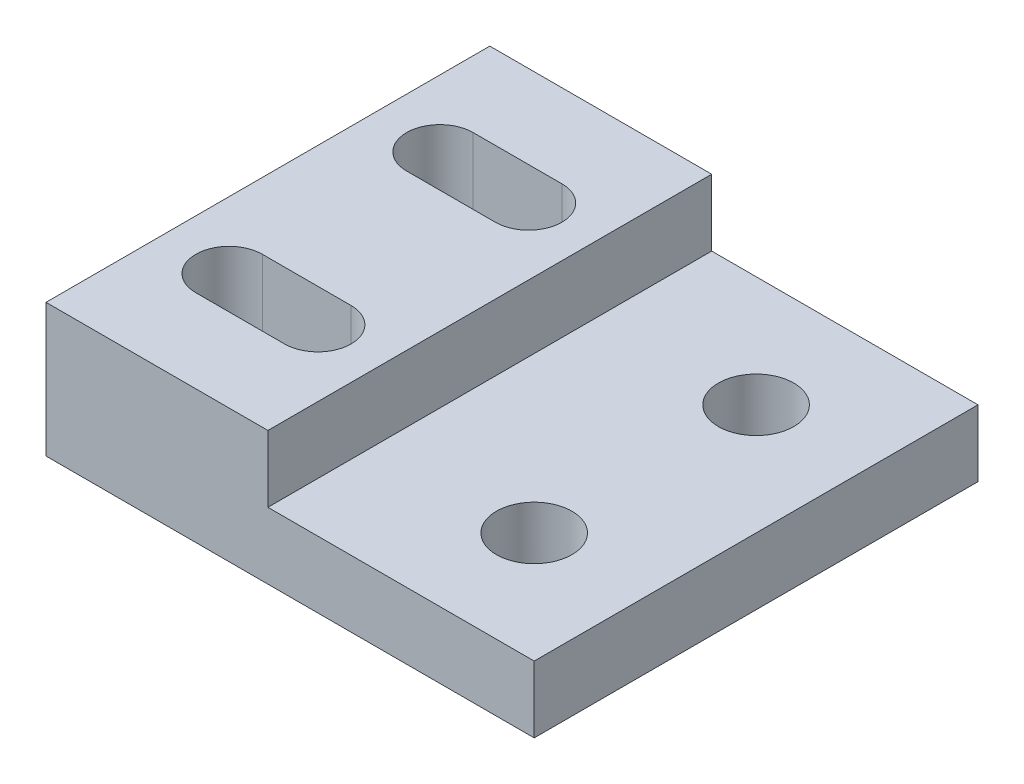
ISO-10303-21;
HEADER;
FILE_DESCRIPTION(('STEP AP214'),'2;1');
FILE_NAME('part.step','',(''),(''),'','','');
FILE_SCHEMA(('AUTOMOTIVE_DESIGN { 1 0 10303 214 1 1 1 1 }'));
ENDSEC;
DATA;
#1=APPLICATION_CONTEXT('core data for automotive mechanical design processes');
#2=APPLICATION_PROTOCOL_DEFINITION('international standard','automotive_design',2000,#1);
#3=PRODUCT_CONTEXT('',#1,'mechanical');
#4=PRODUCT('Part','Part','',(#3));
#5=PRODUCT_RELATED_PRODUCT_CATEGORY('part','',(#4));
#6=PRODUCT_DEFINITION_FORMATION('','',#4);
#7=PRODUCT_DEFINITION_CONTEXT('part definition',#1,'design');
#8=PRODUCT_DEFINITION('design','',#6,#7);
#9=PRODUCT_DEFINITION_SHAPE('','',#8);
#10=(LENGTH_UNIT() NAMED_UNIT(*) SI_UNIT(.MILLI.,.METRE.));
#11=(NAMED_UNIT(*) PLANE_ANGLE_UNIT() SI_UNIT($,.RADIAN.));
#12=(NAMED_UNIT(*) SI_UNIT($,.STERADIAN.) SOLID_ANGLE_UNIT());
#13=UNCERTAINTY_MEASURE_WITH_UNIT(LENGTH_MEASURE(1.E-05),#10,'distance_accuracy_value','');
#14=(GEOMETRIC_REPRESENTATION_CONTEXT(3) GLOBAL_UNCERTAINTY_ASSIGNED_CONTEXT((#13)) GLOBAL_UNIT_ASSIGNED_CONTEXT((#10,
#11,#12)) REPRESENTATION_CONTEXT('',''));
#15=CARTESIAN_POINT('',(0.,0.,0.));
#16=DIRECTION('',(0.,0.,1.));
#17=DIRECTION('',(1.,0.,0.));
#18=AXIS2_PLACEMENT_3D('',#15,#16,#17);
#19=CARTESIAN_POINT('',(11.,3.,10.));
#20=DIRECTION('',(-1.,0.,0.));
#21=DIRECTION('',(0.,0.,1.));
#22=AXIS2_PLACEMENT_3D('',#19,#20,#21);
#23=PLANE('',#22);
#24=DIRECTION('',(0.,0.,-1.));
#25=VECTOR('',#24,1.);
#26=CARTESIAN_POINT('',(11.,0.,10.));
#27=LINE('',#26,#25);
#28=CARTESIAN_POINT('',(11.,0.,10.));
#29=VERTEX_POINT('',#28);
#30=CARTESIAN_POINT('',(11.,0.,-10.));
#31=VERTEX_POINT('',#30);
#32=EDGE_CURVE('E285',#29,#31,#27,.T.);
#33=ORIENTED_EDGE('',*,*,#32,.T.);
#34=DIRECTION('',(0.,-1.,0.));
#35=VECTOR('',#34,1.);
#36=CARTESIAN_POINT('',(11.,3.,-10.));
#37=LINE('',#36,#35);
#38=CARTESIAN_POINT('',(11.,3.,-10.));
#39=VERTEX_POINT('',#38);
#40=EDGE_CURVE('E11',#39,#31,#37,.T.);
#41=ORIENTED_EDGE('',*,*,#40,.F.);
#42=DIRECTION('',(0.,0.,-1.));
#43=VECTOR('',#42,1.);
#44=CARTESIAN_POINT('',(11.,3.,10.));
#45=LINE('',#44,#43);
#46=CARTESIAN_POINT('',(11.,3.,10.));
#47=VERTEX_POINT('',#46);
#48=EDGE_CURVE('E273',#47,#39,#45,.T.);
#49=ORIENTED_EDGE('',*,*,#48,.F.);
#50=DIRECTION('',(0.,-1.,0.));
#51=VECTOR('',#50,1.);
#52=CARTESIAN_POINT('',(11.,3.,10.));
#53=LINE('',#52,#51);
#54=EDGE_CURVE('E284',#47,#29,#53,.T.);
#55=ORIENTED_EDGE('',*,*,#54,.T.);
#56=EDGE_LOOP('',(#33,#41,#49,#55));
#57=FACE_BOUND('',#56,.T.);
#58=ADVANCED_FACE('F41',(#57),#23,.F.);
#59=CARTESIAN_POINT('',(-11.,3.,-10.));
#60=DIRECTION('',(0.,0.,1.));
#61=DIRECTION('',(1.,0.,0.));
#62=AXIS2_PLACEMENT_3D('',#59,#60,#61);
#63=PLANE('',#62);
#64=DIRECTION('',(-1.,0.,0.));
#65=VECTOR('',#64,1.);
#66=CARTESIAN_POINT('',(-11.,0.,-10.));
#67=LINE('',#66,#65);
#68=CARTESIAN_POINT('',(-11.,0.,-10.));
#69=VERTEX_POINT('',#68);
#70=EDGE_CURVE('E289',#31,#69,#67,.T.);
#71=ORIENTED_EDGE('',*,*,#70,.T.);
#72=DIRECTION('',(0.,-1.,0.));
#73=VECTOR('',#72,1.);
#74=CARTESIAN_POINT('',(-11.,3.,-10.));
#75=LINE('',#74,#73);
#76=CARTESIAN_POINT('',(-11.,6.,-10.));
#77=VERTEX_POINT('',#76);
#78=EDGE_CURVE('E50',#77,#69,#75,.T.);
#79=ORIENTED_EDGE('',*,*,#78,.F.);
#80=DIRECTION('',(-1.,0.,0.));
#81=VECTOR('',#80,1.);
#82=CARTESIAN_POINT('',(0.,6.,-10.));
#83=LINE('',#82,#81);
#84=CARTESIAN_POINT('',(-0.999999999999996,6.,-10.));
#85=VERTEX_POINT('',#84);
#86=EDGE_CURVE('E155',#85,#77,#83,.T.);
#87=ORIENTED_EDGE('',*,*,#86,.F.);
#88=DIRECTION('',(0.,-1.,0.));
#89=VECTOR('',#88,1.);
#90=CARTESIAN_POINT('',(-0.999999999999996,6.,-10.));
#91=LINE('',#90,#89);
#92=CARTESIAN_POINT('',(-0.999999999999996,3.,-10.));
#93=VERTEX_POINT('',#92);
#94=EDGE_CURVE('E143',#85,#93,#91,.T.);
#95=ORIENTED_EDGE('',*,*,#94,.T.);
#96=DIRECTION('',(-1.,0.,0.));
#97=VECTOR('',#96,1.);
#98=CARTESIAN_POINT('',(-11.,3.,-10.));
#99=LINE('',#98,#97);
#100=EDGE_CURVE('E277',#39,#93,#99,.T.);
#101=ORIENTED_EDGE('',*,*,#100,.F.);
#102=ORIENTED_EDGE('',*,*,#40,.T.);
#103=EDGE_LOOP('',(#71,#79,#87,#95,#101,#102));
#104=FACE_BOUND('',#103,.T.);
#105=ADVANCED_FACE('F156',(#104),#63,.F.);
#106=CARTESIAN_POINT('',(-11.,3.,10.));
#107=DIRECTION('',(1.,0.,0.));
#108=DIRECTION('',(0.,0.,-1.));
#109=AXIS2_PLACEMENT_3D('',#106,#107,#108);
#110=PLANE('',#109);
#111=DIRECTION('',(0.,0.,1.));
#112=VECTOR('',#111,1.);
#113=CARTESIAN_POINT('',(-11.,0.,10.));
#114=LINE('',#113,#112);
#115=CARTESIAN_POINT('',(-11.,0.,10.));
#116=VERTEX_POINT('',#115);
#117=EDGE_CURVE('E292',#69,#116,#114,.T.);
#118=ORIENTED_EDGE('',*,*,#117,.T.);
#119=DIRECTION('',(0.,-1.,0.));
#120=VECTOR('',#119,1.);
#121=CARTESIAN_POINT('',(-11.,3.,10.));
#122=LINE('',#121,#120);
#123=CARTESIAN_POINT('',(-11.,6.,10.));
#124=VERTEX_POINT('',#123);
#125=EDGE_CURVE('E300',#124,#116,#122,.T.);
#126=ORIENTED_EDGE('',*,*,#125,.F.);
#127=DIRECTION('',(0.,0.,1.));
#128=VECTOR('',#127,1.);
#129=CARTESIAN_POINT('',(-11.,6.,0.));
#130=LINE('',#129,#128);
#131=EDGE_CURVE('E162',#77,#124,#130,.T.);
#132=ORIENTED_EDGE('',*,*,#131,.F.);
#133=ORIENTED_EDGE('',*,*,#78,.T.);
#134=EDGE_LOOP('',(#118,#126,#132,#133));
#135=FACE_BOUND('',#134,.T.);
#136=ADVANCED_FACE('F329',(#135),#110,.F.);
#137=CARTESIAN_POINT('',(-11.,3.,10.));
#138=DIRECTION('',(0.,0.,-1.));
#139=DIRECTION('',(-1.,0.,0.));
#140=AXIS2_PLACEMENT_3D('',#137,#138,#139);
#141=PLANE('',#140);
#142=DIRECTION('',(1.,0.,0.));
#143=VECTOR('',#142,1.);
#144=CARTESIAN_POINT('',(-11.,0.,10.));
#145=LINE('',#144,#143);
#146=EDGE_CURVE('E278',#116,#29,#145,.T.);
#147=ORIENTED_EDGE('',*,*,#146,.T.);
#148=ORIENTED_EDGE('',*,*,#54,.F.);
#149=DIRECTION('',(1.,0.,0.));
#150=VECTOR('',#149,1.);
#151=CARTESIAN_POINT('',(-11.,3.,10.));
#152=LINE('',#151,#150);
#153=CARTESIAN_POINT('',(-0.999999999999994,3.,10.));
#154=VERTEX_POINT('',#153);
#155=EDGE_CURVE('E281',#154,#47,#152,.T.);
#156=ORIENTED_EDGE('',*,*,#155,.F.);
#157=DIRECTION('',(0.,-1.,0.));
#158=VECTOR('',#157,1.);
#159=CARTESIAN_POINT('',(-0.999999999999994,6.,10.));
#160=LINE('',#159,#158);
#161=CARTESIAN_POINT('',(-0.999999999999994,6.,10.));
#162=VERTEX_POINT('',#161);
#163=EDGE_CURVE('E58',#162,#154,#160,.T.);
#164=ORIENTED_EDGE('',*,*,#163,.F.);
#165=DIRECTION('',(1.,0.,0.));
#166=VECTOR('',#165,1.);
#167=CARTESIAN_POINT('',(0.,6.,10.));
#168=LINE('',#167,#166);
#169=EDGE_CURVE('E167',#124,#162,#168,.T.);
#170=ORIENTED_EDGE('',*,*,#169,.F.);
#171=ORIENTED_EDGE('',*,*,#125,.T.);
#172=EDGE_LOOP('',(#147,#148,#156,#164,#170,#171));
#173=FACE_BOUND('',#172,.T.);
#174=ADVANCED_FACE('F327',(#173),#141,.F.);
#175=CARTESIAN_POINT('',(0.,3.,0.));
#176=DIRECTION('',(0.,-1.,0.));
#177=DIRECTION('',(0.,0.,-1.));
#178=AXIS2_PLACEMENT_3D('',#175,#176,#177);
#179=PLANE('',#178);
#180=CARTESIAN_POINT('',(6.,3.,-5.));
#181=DIRECTION('',(0.,1.,0.));
#182=DIRECTION('',(0.,0.,1.));
#183=AXIS2_PLACEMENT_3D('',#180,#181,#182);
#184=CIRCLE('',#183,1.7);
#185=CARTESIAN_POINT('',(6.,3.,-3.3));
#186=VERTEX_POINT('',#185);
#187=EDGE_CURVE('E230',#186,#186,#184,.T.);
#188=ORIENTED_EDGE('',*,*,#187,.F.);
#189=EDGE_LOOP('',(#188));
#190=FACE_BOUND('',#189,.T.);
#191=CARTESIAN_POINT('',(6.,3.,5.));
#192=DIRECTION('',(0.,1.,0.));
#193=DIRECTION('',(0.,0.,1.));
#194=AXIS2_PLACEMENT_3D('',#191,#192,#193);
#195=CIRCLE('',#194,1.7);
#196=CARTESIAN_POINT('',(6.,3.,6.7));
#197=VERTEX_POINT('',#196);
#198=EDGE_CURVE('E268',#197,#197,#195,.T.);
#199=ORIENTED_EDGE('',*,*,#198,.F.);
#200=EDGE_LOOP('',(#199));
#201=FACE_BOUND('',#200,.T.);
#202=ORIENTED_EDGE('',*,*,#100,.T.);
#203=DIRECTION('',(0.,0.,1.));
#204=VECTOR('',#203,1.);
#205=CARTESIAN_POINT('',(-0.999999999999995,3.,0.));
#206=LINE('',#205,#204);
#207=EDGE_CURVE('E148',#93,#154,#206,.T.);
#208=ORIENTED_EDGE('',*,*,#207,.T.);
#209=ORIENTED_EDGE('',*,*,#155,.T.);
#210=ORIENTED_EDGE('',*,*,#48,.T.);
#211=EDGE_LOOP('',(#202,#208,#209,#210));
#212=FACE_BOUND('',#211,.T.);
#213=ADVANCED_FACE('F315',(#190,#201,#212),#179,.F.);
#214=CARTESIAN_POINT('',(0.,0.,0.));
#215=DIRECTION('',(0.,-1.,0.));
#216=DIRECTION('',(0.,0.,-1.));
#217=AXIS2_PLACEMENT_3D('',#214,#215,#216);
#218=PLANE('',#217);
#219=CARTESIAN_POINT('',(-8.,0.,-4.75));
#220=DIRECTION('',(0.,1.,0.));
#221=DIRECTION('',(0.,0.,1.));
#222=AXIS2_PLACEMENT_3D('',#219,#220,#221);
#223=CIRCLE('',#222,1.5);
#224=CARTESIAN_POINT('',(-8.,0.,-6.25));
#225=VERTEX_POINT('',#224);
#226=CARTESIAN_POINT('',(-8.,0.,-3.25));
#227=VERTEX_POINT('',#226);
#228=EDGE_CURVE('E211',#225,#227,#223,.T.);
#229=ORIENTED_EDGE('',*,*,#228,.T.);
#230=DIRECTION('',(1.,0.,0.));
#231=VECTOR('',#230,1.);
#232=CARTESIAN_POINT('',(-8.,0.,-3.25));
#233=LINE('',#232,#231);
#234=CARTESIAN_POINT('',(-4.,0.,-3.25));
#235=VERTEX_POINT('',#234);
#236=EDGE_CURVE('E215',#227,#235,#233,.T.);
#237=ORIENTED_EDGE('',*,*,#236,.T.);
#238=CARTESIAN_POINT('',(-4.,0.,-4.75));
#239=DIRECTION('',(0.,1.,0.));
#240=DIRECTION('',(0.,0.,1.));
#241=AXIS2_PLACEMENT_3D('',#238,#239,#240);
#242=CIRCLE('',#241,1.5);
#243=CARTESIAN_POINT('',(-4.,0.,-6.25));
#244=VERTEX_POINT('',#243);
#245=EDGE_CURVE('E66',#235,#244,#242,.T.);
#246=ORIENTED_EDGE('',*,*,#245,.T.);
#247=DIRECTION('',(-1.,0.,0.));
#248=VECTOR('',#247,1.);
#249=CARTESIAN_POINT('',(-8.,0.,-6.25));
#250=LINE('',#249,#248);
#251=EDGE_CURVE('E222',#244,#225,#250,.T.);
#252=ORIENTED_EDGE('',*,*,#251,.T.);
#253=EDGE_LOOP('',(#229,#237,#246,#252));
#254=FACE_BOUND('',#253,.T.);
#255=CARTESIAN_POINT('',(-8.,0.,4.75));
#256=DIRECTION('',(0.,1.,0.));
#257=DIRECTION('',(0.,0.,1.));
#258=AXIS2_PLACEMENT_3D('',#255,#256,#257);
#259=CIRCLE('',#258,1.5);
#260=CARTESIAN_POINT('',(-8.,0.,3.25));
#261=VERTEX_POINT('',#260);
#262=CARTESIAN_POINT('',(-8.,0.,6.25));
#263=VERTEX_POINT('',#262);
#264=EDGE_CURVE('E152',#261,#263,#259,.T.);
#265=ORIENTED_EDGE('',*,*,#264,.T.);
#266=DIRECTION('',(1.,0.,0.));
#267=VECTOR('',#266,1.);
#268=CARTESIAN_POINT('',(-8.,0.,6.25));
#269=LINE('',#268,#267);
#270=CARTESIAN_POINT('',(-4.,0.,6.25));
#271=VERTEX_POINT('',#270);
#272=EDGE_CURVE('E242',#263,#271,#269,.T.);
#273=ORIENTED_EDGE('',*,*,#272,.T.);
#274=CARTESIAN_POINT('',(-4.,0.,4.75));
#275=DIRECTION('',(0.,1.,0.));
#276=DIRECTION('',(0.,0.,1.));
#277=AXIS2_PLACEMENT_3D('',#274,#275,#276);
#278=CIRCLE('',#277,1.5);
#279=CARTESIAN_POINT('',(-4.,0.,3.25));
#280=VERTEX_POINT('',#279);
#281=EDGE_CURVE('E246',#271,#280,#278,.T.);
#282=ORIENTED_EDGE('',*,*,#281,.T.);
#283=DIRECTION('',(-1.,0.,0.));
#284=VECTOR('',#283,1.);
#285=CARTESIAN_POINT('',(-8.,0.,3.25));
#286=LINE('',#285,#284);
#287=EDGE_CURVE('E250',#280,#261,#286,.T.);
#288=ORIENTED_EDGE('',*,*,#287,.T.);
#289=EDGE_LOOP('',(#265,#273,#282,#288));
#290=FACE_BOUND('',#289,.T.);
#291=CARTESIAN_POINT('',(6.,0.,-5.));
#292=DIRECTION('',(0.,-1.,0.));
#293=DIRECTION('',(0.,0.,-1.));
#294=AXIS2_PLACEMENT_3D('',#291,#292,#293);
#295=CIRCLE('',#294,1.7);
#296=CARTESIAN_POINT('',(6.,0.,-6.7));
#297=VERTEX_POINT('',#296);
#298=EDGE_CURVE('E44',#297,#297,#295,.T.);
#299=ORIENTED_EDGE('',*,*,#298,.F.);
#300=EDGE_LOOP('',(#299));
#301=FACE_BOUND('',#300,.T.);
#302=CARTESIAN_POINT('',(6.,0.,5.));
#303=DIRECTION('',(0.,-1.,0.));
#304=DIRECTION('',(0.,0.,-1.));
#305=AXIS2_PLACEMENT_3D('',#302,#303,#304);
#306=CIRCLE('',#305,1.7);
#307=CARTESIAN_POINT('',(6.,0.,3.3));
#308=VERTEX_POINT('',#307);
#309=EDGE_CURVE('E272',#308,#308,#306,.T.);
#310=ORIENTED_EDGE('',*,*,#309,.F.);
#311=EDGE_LOOP('',(#310));
#312=FACE_BOUND('',#311,.T.);
#313=ORIENTED_EDGE('',*,*,#32,.F.);
#314=ORIENTED_EDGE('',*,*,#146,.F.);
#315=ORIENTED_EDGE('',*,*,#117,.F.);
#316=ORIENTED_EDGE('',*,*,#70,.F.);
#317=EDGE_LOOP('',(#313,#314,#315,#316));
#318=FACE_BOUND('',#317,.T.);
#319=ADVANCED_FACE('F312',(#254,#290,#301,#312,#318),#218,.T.);
#320=CARTESIAN_POINT('',(6.,3.,5.));
#321=DIRECTION('',(0.,1.,0.));
#322=DIRECTION('',(0.,0.,1.));
#323=AXIS2_PLACEMENT_3D('',#320,#321,#322);
#324=CYLINDRICAL_SURFACE('',#323,1.7);
#325=ORIENTED_EDGE('',*,*,#309,.T.);
#326=EDGE_LOOP('',(#325));
#327=FACE_BOUND('',#326,.T.);
#328=ORIENTED_EDGE('',*,*,#198,.T.);
#329=EDGE_LOOP('',(#328));
#330=FACE_BOUND('',#329,.T.);
#331=ADVANCED_FACE('F309',(#327,#330),#324,.F.);
#332=CARTESIAN_POINT('',(6.,3.,-5.));
#333=DIRECTION('',(0.,1.,0.));
#334=DIRECTION('',(0.,0.,1.));
#335=AXIS2_PLACEMENT_3D('',#332,#333,#334);
#336=CYLINDRICAL_SURFACE('',#335,1.7);
#337=ORIENTED_EDGE('',*,*,#298,.T.);
#338=EDGE_LOOP('',(#337));
#339=FACE_BOUND('',#338,.T.);
#340=ORIENTED_EDGE('',*,*,#187,.T.);
#341=EDGE_LOOP('',(#340));
#342=FACE_BOUND('',#341,.T.);
#343=ADVANCED_FACE('F387',(#339,#342),#336,.F.);
#344=CARTESIAN_POINT('',(-8.,0.,4.75));
#345=DIRECTION('',(0.,1.,0.));
#346=DIRECTION('',(0.,0.,1.));
#347=AXIS2_PLACEMENT_3D('',#344,#345,#346);
#348=CYLINDRICAL_SURFACE('',#347,1.5);
#349=DIRECTION('',(0.,1.,0.));
#350=VECTOR('',#349,1.);
#351=CARTESIAN_POINT('',(-8.,0.,3.25));
#352=LINE('',#351,#350);
#353=CARTESIAN_POINT('',(-8.,6.,3.25));
#354=VERTEX_POINT('',#353);
#355=EDGE_CURVE('E216',#261,#354,#352,.T.);
#356=ORIENTED_EDGE('',*,*,#355,.T.);
#357=CARTESIAN_POINT('',(-8.,6.,4.75));
#358=DIRECTION('',(0.,1.,0.));
#359=DIRECTION('',(0.,0.,1.));
#360=AXIS2_PLACEMENT_3D('',#357,#358,#359);
#361=CIRCLE('',#360,1.5);
#362=CARTESIAN_POINT('',(-8.,6.,6.25));
#363=VERTEX_POINT('',#362);
#364=EDGE_CURVE('E185',#363,#354,#361,.F.);
#365=ORIENTED_EDGE('',*,*,#364,.F.);
#366=DIRECTION('',(0.,1.,0.));
#367=VECTOR('',#366,1.);
#368=CARTESIAN_POINT('',(-8.,0.,6.25));
#369=LINE('',#368,#367);
#370=EDGE_CURVE('E254',#263,#363,#369,.T.);
#371=ORIENTED_EDGE('',*,*,#370,.F.);
#372=ORIENTED_EDGE('',*,*,#264,.F.);
#373=EDGE_LOOP('',(#356,#365,#371,#372));
#374=FACE_BOUND('',#373,.T.);
#375=ADVANCED_FACE('F392',(#374),#348,.F.);
#376=CARTESIAN_POINT('',(-8.,0.,3.25));
#377=DIRECTION('',(0.,0.,-1.));
#378=DIRECTION('',(-1.,0.,0.));
#379=AXIS2_PLACEMENT_3D('',#376,#377,#378);
#380=PLANE('',#379);
#381=DIRECTION('',(0.,1.,0.));
#382=VECTOR('',#381,1.);
#383=CARTESIAN_POINT('',(-4.,0.,3.25));
#384=LINE('',#383,#382);
#385=CARTESIAN_POINT('',(-4.,6.,3.25));
#386=VERTEX_POINT('',#385);
#387=EDGE_CURVE('E257',#280,#386,#384,.T.);
#388=ORIENTED_EDGE('',*,*,#387,.T.);
#389=DIRECTION('',(1.,0.,0.));
#390=VECTOR('',#389,1.);
#391=CARTESIAN_POINT('',(0.,6.,3.25));
#392=LINE('',#391,#390);
#393=EDGE_CURVE('E189',#354,#386,#392,.T.);
#394=ORIENTED_EDGE('',*,*,#393,.F.);
#395=ORIENTED_EDGE('',*,*,#355,.F.);
#396=ORIENTED_EDGE('',*,*,#287,.F.);
#397=EDGE_LOOP('',(#388,#394,#395,#396));
#398=FACE_BOUND('',#397,.T.);
#399=ADVANCED_FACE('F399',(#398),#380,.F.);
#400=CARTESIAN_POINT('',(-4.,0.,4.75));
#401=DIRECTION('',(0.,1.,0.));
#402=DIRECTION('',(0.,0.,1.));
#403=AXIS2_PLACEMENT_3D('',#400,#401,#402);
#404=CYLINDRICAL_SURFACE('',#403,1.5);
#405=DIRECTION('',(0.,1.,0.));
#406=VECTOR('',#405,1.);
#407=CARTESIAN_POINT('',(-4.,0.,6.25));
#408=LINE('',#407,#406);
#409=CARTESIAN_POINT('',(-4.,6.,6.25));
#410=VERTEX_POINT('',#409);
#411=EDGE_CURVE('E260',#271,#410,#408,.T.);
#412=ORIENTED_EDGE('',*,*,#411,.T.);
#413=CARTESIAN_POINT('',(-4.,6.,4.75));
#414=DIRECTION('',(0.,1.,0.));
#415=DIRECTION('',(0.,0.,1.));
#416=AXIS2_PLACEMENT_3D('',#413,#414,#415);
#417=CIRCLE('',#416,1.5);
#418=EDGE_CURVE('E177',#386,#410,#417,.F.);
#419=ORIENTED_EDGE('',*,*,#418,.F.);
#420=ORIENTED_EDGE('',*,*,#387,.F.);
#421=ORIENTED_EDGE('',*,*,#281,.F.);
#422=EDGE_LOOP('',(#412,#419,#420,#421));
#423=FACE_BOUND('',#422,.T.);
#424=ADVANCED_FACE('F406',(#423),#404,.F.);
#425=CARTESIAN_POINT('',(-8.,0.,6.25));
#426=DIRECTION('',(0.,0.,1.));
#427=DIRECTION('',(1.,0.,0.));
#428=AXIS2_PLACEMENT_3D('',#425,#426,#427);
#429=PLANE('',#428);
#430=ORIENTED_EDGE('',*,*,#370,.T.);
#431=DIRECTION('',(-1.,0.,0.));
#432=VECTOR('',#431,1.);
#433=CARTESIAN_POINT('',(0.,6.,6.25));
#434=LINE('',#433,#432);
#435=EDGE_CURVE('E181',#410,#363,#434,.T.);
#436=ORIENTED_EDGE('',*,*,#435,.F.);
#437=ORIENTED_EDGE('',*,*,#411,.F.);
#438=ORIENTED_EDGE('',*,*,#272,.F.);
#439=EDGE_LOOP('',(#430,#436,#437,#438));
#440=FACE_BOUND('',#439,.T.);
#441=ADVANCED_FACE('F414',(#440),#429,.F.);
#442=CARTESIAN_POINT('',(-8.,0.,-4.75));
#443=DIRECTION('',(0.,1.,0.));
#444=DIRECTION('',(0.,0.,1.));
#445=AXIS2_PLACEMENT_3D('',#442,#443,#444);
#446=CYLINDRICAL_SURFACE('',#445,1.5);
#447=DIRECTION('',(0.,1.,0.));
#448=VECTOR('',#447,1.);
#449=CARTESIAN_POINT('',(-8.,0.,-6.25));
#450=LINE('',#449,#448);
#451=CARTESIAN_POINT('',(-8.,6.,-6.25));
#452=VERTEX_POINT('',#451);
#453=EDGE_CURVE('E227',#225,#452,#450,.T.);
#454=ORIENTED_EDGE('',*,*,#453,.T.);
#455=CARTESIAN_POINT('',(-8.,6.,-4.75));
#456=DIRECTION('',(0.,1.,0.));
#457=DIRECTION('',(0.,0.,1.));
#458=AXIS2_PLACEMENT_3D('',#455,#456,#457);
#459=CIRCLE('',#458,1.5);
#460=CARTESIAN_POINT('',(-8.,6.,-3.25));
#461=VERTEX_POINT('',#460);
#462=EDGE_CURVE('E201',#461,#452,#459,.F.);
#463=ORIENTED_EDGE('',*,*,#462,.F.);
#464=DIRECTION('',(0.,1.,0.));
#465=VECTOR('',#464,1.);
#466=CARTESIAN_POINT('',(-8.,0.,-3.25));
#467=LINE('',#466,#465);
#468=EDGE_CURVE('E226',#227,#461,#467,.T.);
#469=ORIENTED_EDGE('',*,*,#468,.F.);
#470=ORIENTED_EDGE('',*,*,#228,.F.);
#471=EDGE_LOOP('',(#454,#463,#469,#470));
#472=FACE_BOUND('',#471,.T.);
#473=ADVANCED_FACE('F422',(#472),#446,.F.);
#474=CARTESIAN_POINT('',(-8.,0.,-6.25));
#475=DIRECTION('',(0.,0.,-1.));
#476=DIRECTION('',(-1.,0.,0.));
#477=AXIS2_PLACEMENT_3D('',#474,#475,#476);
#478=PLANE('',#477);
#479=DIRECTION('',(0.,1.,0.));
#480=VECTOR('',#479,1.);
#481=CARTESIAN_POINT('',(-4.,0.,-6.25));
#482=LINE('',#481,#480);
#483=CARTESIAN_POINT('',(-4.,6.,-6.25));
#484=VERTEX_POINT('',#483);
#485=EDGE_CURVE('E231',#244,#484,#482,.T.);
#486=ORIENTED_EDGE('',*,*,#485,.T.);
#487=DIRECTION('',(1.,0.,0.));
#488=VECTOR('',#487,1.);
#489=CARTESIAN_POINT('',(0.,6.,-6.25));
#490=LINE('',#489,#488);
#491=EDGE_CURVE('E205',#452,#484,#490,.T.);
#492=ORIENTED_EDGE('',*,*,#491,.F.);
#493=ORIENTED_EDGE('',*,*,#453,.F.);
#494=ORIENTED_EDGE('',*,*,#251,.F.);
#495=EDGE_LOOP('',(#486,#492,#493,#494));
#496=FACE_BOUND('',#495,.T.);
#497=ADVANCED_FACE('F430',(#496),#478,.F.);
#498=CARTESIAN_POINT('',(-4.,0.,-4.75));
#499=DIRECTION('',(0.,1.,0.));
#500=DIRECTION('',(0.,0.,1.));
#501=AXIS2_PLACEMENT_3D('',#498,#499,#500);
#502=CYLINDRICAL_SURFACE('',#501,1.5);
#503=DIRECTION('',(0.,1.,0.));
#504=VECTOR('',#503,1.);
#505=CARTESIAN_POINT('',(-4.,0.,-3.25));
#506=LINE('',#505,#504);
#507=CARTESIAN_POINT('',(-4.,6.,-3.25));
#508=VERTEX_POINT('',#507);
#509=EDGE_CURVE('E234',#235,#508,#506,.T.);
#510=ORIENTED_EDGE('',*,*,#509,.T.);
#511=CARTESIAN_POINT('',(-4.,6.,-4.75));
#512=DIRECTION('',(0.,1.,0.));
#513=DIRECTION('',(0.,0.,1.));
#514=AXIS2_PLACEMENT_3D('',#511,#512,#513);
#515=CIRCLE('',#514,1.5);
#516=EDGE_CURVE('E193',#484,#508,#515,.F.);
#517=ORIENTED_EDGE('',*,*,#516,.F.);
#518=ORIENTED_EDGE('',*,*,#485,.F.);
#519=ORIENTED_EDGE('',*,*,#245,.F.);
#520=EDGE_LOOP('',(#510,#517,#518,#519));
#521=FACE_BOUND('',#520,.T.);
#522=ADVANCED_FACE('F438',(#521),#502,.F.);
#523=CARTESIAN_POINT('',(-8.,0.,-3.25));
#524=DIRECTION('',(0.,0.,1.));
#525=DIRECTION('',(1.,0.,0.));
#526=AXIS2_PLACEMENT_3D('',#523,#524,#525);
#527=PLANE('',#526);
#528=ORIENTED_EDGE('',*,*,#468,.T.);
#529=DIRECTION('',(-1.,0.,0.));
#530=VECTOR('',#529,1.);
#531=CARTESIAN_POINT('',(0.,6.,-3.25));
#532=LINE('',#531,#530);
#533=EDGE_CURVE('E197',#508,#461,#532,.T.);
#534=ORIENTED_EDGE('',*,*,#533,.F.);
#535=ORIENTED_EDGE('',*,*,#509,.F.);
#536=ORIENTED_EDGE('',*,*,#236,.F.);
#537=EDGE_LOOP('',(#528,#534,#535,#536));
#538=FACE_BOUND('',#537,.T.);
#539=ADVANCED_FACE('F446',(#538),#527,.F.);
#540=CARTESIAN_POINT('',(-0.999999999999995,6.,0.));
#541=DIRECTION('',(1.,0.,0.));
#542=DIRECTION('',(0.,0.,-1.));
#543=AXIS2_PLACEMENT_3D('',#540,#541,#542);
#544=PLANE('',#543);
#545=ORIENTED_EDGE('',*,*,#207,.F.);
#546=ORIENTED_EDGE('',*,*,#94,.F.);
#547=DIRECTION('',(0.,0.,1.));
#548=VECTOR('',#547,1.);
#549=CARTESIAN_POINT('',(-0.999999999999995,6.,0.));
#550=LINE('',#549,#548);
#551=EDGE_CURVE('E147',#85,#162,#550,.T.);
#552=ORIENTED_EDGE('',*,*,#551,.T.);
#553=ORIENTED_EDGE('',*,*,#163,.T.);
#554=EDGE_LOOP('',(#545,#546,#552,#553));
#555=FACE_BOUND('',#554,.T.);
#556=ADVANCED_FACE('F145',(#555),#544,.T.);
#557=CARTESIAN_POINT('',(0.,6.,0.));
#558=DIRECTION('',(0.,1.,0.));
#559=DIRECTION('',(0.,0.,1.));
#560=AXIS2_PLACEMENT_3D('',#557,#558,#559);
#561=PLANE('',#560);
#562=ORIENTED_EDGE('',*,*,#551,.F.);
#563=ORIENTED_EDGE('',*,*,#86,.T.);
#564=ORIENTED_EDGE('',*,*,#131,.T.);
#565=ORIENTED_EDGE('',*,*,#169,.T.);
#566=EDGE_LOOP('',(#562,#563,#564,#565));
#567=FACE_BOUND('',#566,.T.);
#568=ORIENTED_EDGE('',*,*,#418,.T.);
#569=ORIENTED_EDGE('',*,*,#435,.T.);
#570=ORIENTED_EDGE('',*,*,#364,.T.);
#571=ORIENTED_EDGE('',*,*,#393,.T.);
#572=EDGE_LOOP('',(#568,#569,#570,#571));
#573=FACE_BOUND('',#572,.T.);
#574=ORIENTED_EDGE('',*,*,#516,.T.);
#575=ORIENTED_EDGE('',*,*,#533,.T.);
#576=ORIENTED_EDGE('',*,*,#462,.T.);
#577=ORIENTED_EDGE('',*,*,#491,.T.);
#578=EDGE_LOOP('',(#574,#575,#576,#577));
#579=FACE_BOUND('',#578,.T.);
#580=ADVANCED_FACE('F164',(#567,#573,#579),#561,.T.);
#581=CLOSED_SHELL('',(#58,#105,#136,#174,#213,#319,#331,#343,#375,#399,#424,#441,#473,#497,#522,
#539,#556,#580));
#582=MANIFOLD_SOLID_BREP('B2',#581);
#583=ADVANCED_BREP_SHAPE_REPRESENTATION('',(#18,#582),#14);
#584=SHAPE_DEFINITION_REPRESENTATION(#9,#583);
ENDSEC;
END-ISO-10303-21;
